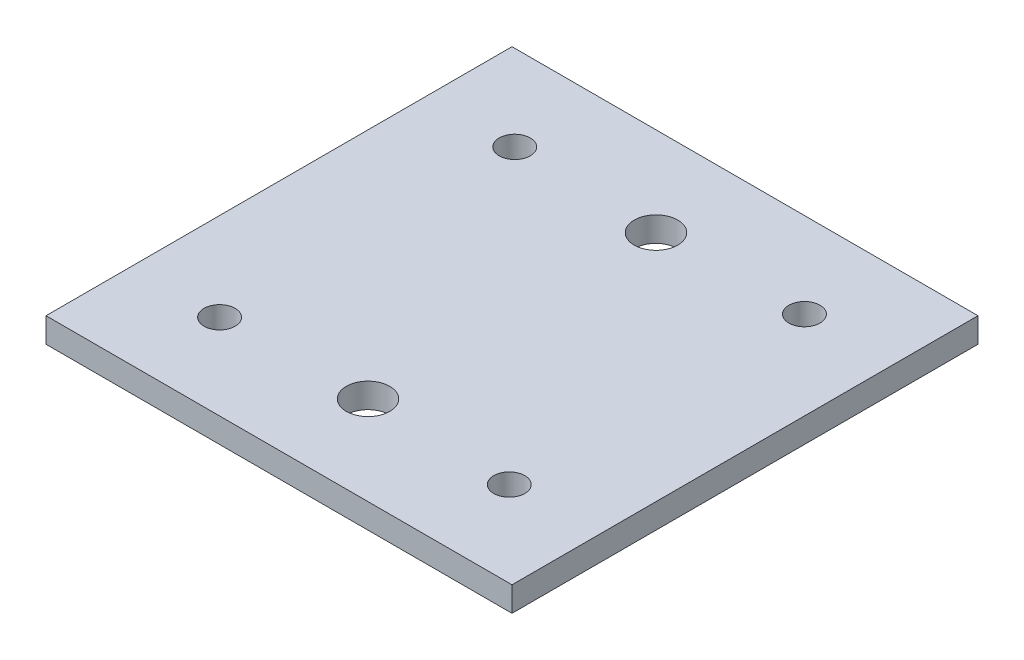
ISO-10303-21;
HEADER;
FILE_DESCRIPTION(('STEP AP214'),'2;1');
FILE_NAME('part.step','',(''),(''),'','','');
FILE_SCHEMA(('AUTOMOTIVE_DESIGN { 1 0 10303 214 1 1 1 1 }'));
ENDSEC;
DATA;
#1=APPLICATION_CONTEXT('core data for automotive mechanical design processes');
#2=APPLICATION_PROTOCOL_DEFINITION('international standard','automotive_design',2000,#1);
#3=PRODUCT_CONTEXT('',#1,'mechanical');
#4=PRODUCT('Part','Part','',(#3));
#5=PRODUCT_RELATED_PRODUCT_CATEGORY('part','',(#4));
#6=PRODUCT_DEFINITION_FORMATION('','',#4);
#7=PRODUCT_DEFINITION_CONTEXT('part definition',#1,'design');
#8=PRODUCT_DEFINITION('design','',#6,#7);
#9=PRODUCT_DEFINITION_SHAPE('','',#8);
#10=(LENGTH_UNIT() NAMED_UNIT(*) SI_UNIT(.MILLI.,.METRE.));
#11=(NAMED_UNIT(*) PLANE_ANGLE_UNIT() SI_UNIT($,.RADIAN.));
#12=(NAMED_UNIT(*) SI_UNIT($,.STERADIAN.) SOLID_ANGLE_UNIT());
#13=UNCERTAINTY_MEASURE_WITH_UNIT(LENGTH_MEASURE(1.E-05),#10,'distance_accuracy_value','');
#14=(GEOMETRIC_REPRESENTATION_CONTEXT(3) GLOBAL_UNCERTAINTY_ASSIGNED_CONTEXT((#13)) GLOBAL_UNIT_ASSIGNED_CONTEXT((#10,
#11,#12)) REPRESENTATION_CONTEXT('',''));
#15=CARTESIAN_POINT('',(0.,0.,0.));
#16=DIRECTION('',(0.,0.,1.));
#17=DIRECTION('',(1.,0.,0.));
#18=AXIS2_PLACEMENT_3D('',#15,#16,#17);
#19=CARTESIAN_POINT('',(150.,-7.96221322537112,0.));
#20=DIRECTION('',(0.,1.,0.));
#21=DIRECTION('',(0.,0.,1.));
#22=AXIS2_PLACEMENT_3D('',#19,#20,#21);
#23=PLANE('',#22);
#24=CARTESIAN_POINT('',(121.628503538993,-7.96221322537112,-122.5));
#25=DIRECTION('',(0.,-1.,0.));
#26=DIRECTION('',(0.,0.,1.));
#27=AXIS2_PLACEMENT_3D('',#24,#25,#26);
#28=CIRCLE('',#27,5.00000000000001);
#29=CARTESIAN_POINT('',(121.628503538993,-7.96221322537112,-117.5));
#30=VERTEX_POINT('',#29);
#31=EDGE_CURVE('E127',#30,#30,#28,.T.);
#32=ORIENTED_EDGE('',*,*,#31,.F.);
#33=EDGE_LOOP('',(#32));
#34=FACE_BOUND('',#33,.T.);
#35=CARTESIAN_POINT('',(121.628503538993,-7.96221322537112,-27.5));
#36=DIRECTION('',(0.,-1.,0.));
#37=DIRECTION('',(0.,0.,-1.));
#38=AXIS2_PLACEMENT_3D('',#35,#36,#37);
#39=CIRCLE('',#38,4.99999999999999);
#40=CARTESIAN_POINT('',(121.628503538993,-7.96221322537112,-32.5));
#41=VERTEX_POINT('',#40);
#42=EDGE_CURVE('E133',#41,#41,#39,.T.);
#43=ORIENTED_EDGE('',*,*,#42,.F.);
#44=EDGE_LOOP('',(#43));
#45=FACE_BOUND('',#44,.T.);
#46=CARTESIAN_POINT('',(28.3714964610074,-7.96221322537112,-27.5));
#47=DIRECTION('',(0.,-1.,0.));
#48=DIRECTION('',(0.,0.,1.));
#49=AXIS2_PLACEMENT_3D('',#46,#47,#48);
#50=CIRCLE('',#49,4.99999999999999);
#51=CARTESIAN_POINT('',(28.3714964610074,-7.96221322537112,-22.5));
#52=VERTEX_POINT('',#51);
#53=EDGE_CURVE('E139',#52,#52,#50,.T.);
#54=ORIENTED_EDGE('',*,*,#53,.F.);
#55=EDGE_LOOP('',(#54));
#56=FACE_BOUND('',#55,.T.);
#57=CARTESIAN_POINT('',(28.3714964610074,-7.96221322537112,-122.5));
#58=DIRECTION('',(0.,-1.,0.));
#59=DIRECTION('',(0.,0.,-1.));
#60=AXIS2_PLACEMENT_3D('',#57,#58,#59);
#61=CIRCLE('',#60,5.);
#62=CARTESIAN_POINT('',(28.3714964610074,-7.96221322537112,-127.5));
#63=VERTEX_POINT('',#62);
#64=EDGE_CURVE('E121',#63,#63,#61,.T.);
#65=ORIENTED_EDGE('',*,*,#64,.F.);
#66=EDGE_LOOP('',(#65));
#67=FACE_BOUND('',#66,.T.);
#68=DIRECTION('',(0.,0.,-1.));
#69=VECTOR('',#68,1.);
#70=CARTESIAN_POINT('',(0.,-7.96221322537112,0.));
#71=LINE('',#70,#69);
#72=CARTESIAN_POINT('',(0.,-7.96221322537112,0.));
#73=VERTEX_POINT('',#72);
#74=CARTESIAN_POINT('',(0.,-7.96221322537112,-150.));
#75=VERTEX_POINT('',#74);
#76=EDGE_CURVE('E88',#73,#75,#71,.T.);
#77=ORIENTED_EDGE('',*,*,#76,.T.);
#78=DIRECTION('',(-1.,0.,0.));
#79=VECTOR('',#78,1.);
#80=CARTESIAN_POINT('',(150.,-7.96221322537112,-150.));
#81=LINE('',#80,#79);
#82=CARTESIAN_POINT('',(150.,-7.96221322537112,-150.));
#83=VERTEX_POINT('',#82);
#84=EDGE_CURVE('E42',#83,#75,#81,.T.);
#85=ORIENTED_EDGE('',*,*,#84,.F.);
#86=DIRECTION('',(0.,0.,-1.));
#87=VECTOR('',#86,1.);
#88=CARTESIAN_POINT('',(150.,-7.96221322537112,0.));
#89=LINE('',#88,#87);
#90=CARTESIAN_POINT('',(150.,-7.96221322537112,0.));
#91=VERTEX_POINT('',#90);
#92=EDGE_CURVE('E75',#91,#83,#89,.T.);
#93=ORIENTED_EDGE('',*,*,#92,.F.);
#94=DIRECTION('',(-1.,0.,0.));
#95=VECTOR('',#94,1.);
#96=CARTESIAN_POINT('',(150.,-7.96221322537112,0.));
#97=LINE('',#96,#95);
#98=EDGE_CURVE('E11',#91,#73,#97,.T.);
#99=ORIENTED_EDGE('',*,*,#98,.T.);
#100=EDGE_LOOP('',(#77,#85,#93,#99));
#101=FACE_BOUND('',#100,.T.);
#102=CARTESIAN_POINT('',(74.999907538728,-7.96221322537112,-28.6526060996607));
#103=DIRECTION('',(0.,-1.,0.));
#104=DIRECTION('',(0.,0.,-1.));
#105=AXIS2_PLACEMENT_3D('',#102,#103,#104);
#106=CIRCLE('',#105,7.0000000000002);
#107=CARTESIAN_POINT('',(74.999907538728,-7.96221322537112,-35.6526060996609));
#108=VERTEX_POINT('',#107);
#109=EDGE_CURVE('E109',#108,#108,#106,.T.);
#110=ORIENTED_EDGE('',*,*,#109,.F.);
#111=EDGE_LOOP('',(#110));
#112=FACE_BOUND('',#111,.T.);
#113=CARTESIAN_POINT('',(74.999907538728,-7.96221322537112,-121.347393900339));
#114=DIRECTION('',(0.,1.,0.));
#115=DIRECTION('',(0.,0.,1.));
#116=AXIS2_PLACEMENT_3D('',#113,#114,#115);
#117=CIRCLE('',#116,7.0000000000002);
#118=CARTESIAN_POINT('',(74.999907538728,-7.96221322537112,-114.347393900339));
#119=VERTEX_POINT('',#118);
#120=EDGE_CURVE('E99',#119,#119,#117,.T.);
#121=ORIENTED_EDGE('',*,*,#120,.T.);
#122=EDGE_LOOP('',(#121));
#123=FACE_BOUND('',#122,.T.);
#124=ADVANCED_FACE('F33',(#34,#45,#56,#67,#101,#112,#123),#23,.F.);
#125=CARTESIAN_POINT('',(150.,0.,0.));
#126=DIRECTION('',(0.,1.,0.));
#127=DIRECTION('',(0.,0.,1.));
#128=AXIS2_PLACEMENT_3D('',#125,#126,#127);
#129=PLANE('',#128);
#130=CARTESIAN_POINT('',(121.628503538993,0.,-122.5));
#131=DIRECTION('',(0.,-1.,0.));
#132=DIRECTION('',(0.,0.,1.));
#133=AXIS2_PLACEMENT_3D('',#130,#131,#132);
#134=CIRCLE('',#133,5.00000000000001);
#135=CARTESIAN_POINT('',(121.628503538993,0.,-117.5));
#136=VERTEX_POINT('',#135);
#137=EDGE_CURVE('E130',#136,#136,#134,.T.);
#138=ORIENTED_EDGE('',*,*,#137,.T.);
#139=EDGE_LOOP('',(#138));
#140=FACE_BOUND('',#139,.T.);
#141=CARTESIAN_POINT('',(121.628503538993,0.,-27.5));
#142=DIRECTION('',(0.,-1.,0.));
#143=DIRECTION('',(0.,0.,-1.));
#144=AXIS2_PLACEMENT_3D('',#141,#142,#143);
#145=CIRCLE('',#144,4.99999999999999);
#146=CARTESIAN_POINT('',(121.628503538993,0.,-32.5));
#147=VERTEX_POINT('',#146);
#148=EDGE_CURVE('E136',#147,#147,#145,.T.);
#149=ORIENTED_EDGE('',*,*,#148,.T.);
#150=EDGE_LOOP('',(#149));
#151=FACE_BOUND('',#150,.T.);
#152=CARTESIAN_POINT('',(28.3714964610074,0.,-27.5));
#153=DIRECTION('',(0.,-1.,0.));
#154=DIRECTION('',(0.,0.,1.));
#155=AXIS2_PLACEMENT_3D('',#152,#153,#154);
#156=CIRCLE('',#155,4.99999999999999);
#157=CARTESIAN_POINT('',(28.3714964610074,0.,-22.5));
#158=VERTEX_POINT('',#157);
#159=EDGE_CURVE('E124',#158,#158,#156,.T.);
#160=ORIENTED_EDGE('',*,*,#159,.T.);
#161=EDGE_LOOP('',(#160));
#162=FACE_BOUND('',#161,.T.);
#163=CARTESIAN_POINT('',(28.3714964610074,0.,-122.5));
#164=DIRECTION('',(0.,-1.,0.));
#165=DIRECTION('',(0.,0.,-1.));
#166=AXIS2_PLACEMENT_3D('',#163,#164,#165);
#167=CIRCLE('',#166,5.);
#168=CARTESIAN_POINT('',(28.3714964610074,0.,-127.5));
#169=VERTEX_POINT('',#168);
#170=EDGE_CURVE('E113',#169,#169,#167,.T.);
#171=ORIENTED_EDGE('',*,*,#170,.T.);
#172=EDGE_LOOP('',(#171));
#173=FACE_BOUND('',#172,.T.);
#174=CARTESIAN_POINT('',(74.999907538728,0.,-28.6526060996607));
#175=DIRECTION('',(0.,-1.,0.));
#176=DIRECTION('',(0.,0.,-1.));
#177=AXIS2_PLACEMENT_3D('',#174,#175,#176);
#178=CIRCLE('',#177,7.0000000000002);
#179=CARTESIAN_POINT('',(74.999907538728,0.,-35.6526060996609));
#180=VERTEX_POINT('',#179);
#181=EDGE_CURVE('E112',#180,#180,#178,.T.);
#182=ORIENTED_EDGE('',*,*,#181,.T.);
#183=EDGE_LOOP('',(#182));
#184=FACE_BOUND('',#183,.T.);
#185=DIRECTION('',(0.,0.,-1.));
#186=VECTOR('',#185,1.);
#187=CARTESIAN_POINT('',(0.,0.,0.));
#188=LINE('',#187,#186);
#189=CARTESIAN_POINT('',(0.,0.,0.));
#190=VERTEX_POINT('',#189);
#191=CARTESIAN_POINT('',(0.,0.,-150.));
#192=VERTEX_POINT('',#191);
#193=EDGE_CURVE('E103',#190,#192,#188,.T.);
#194=ORIENTED_EDGE('',*,*,#193,.F.);
#195=DIRECTION('',(-1.,0.,0.));
#196=VECTOR('',#195,1.);
#197=CARTESIAN_POINT('',(150.,0.,0.));
#198=LINE('',#197,#196);
#199=CARTESIAN_POINT('',(150.,0.,0.));
#200=VERTEX_POINT('',#199);
#201=EDGE_CURVE('E50',#200,#190,#198,.T.);
#202=ORIENTED_EDGE('',*,*,#201,.F.);
#203=DIRECTION('',(0.,0.,-1.));
#204=VECTOR('',#203,1.);
#205=CARTESIAN_POINT('',(150.,0.,0.));
#206=LINE('',#205,#204);
#207=CARTESIAN_POINT('',(150.,0.,-150.));
#208=VERTEX_POINT('',#207);
#209=EDGE_CURVE('E92',#200,#208,#206,.T.);
#210=ORIENTED_EDGE('',*,*,#209,.T.);
#211=DIRECTION('',(-1.,0.,0.));
#212=VECTOR('',#211,1.);
#213=CARTESIAN_POINT('',(150.,0.,-150.));
#214=LINE('',#213,#212);
#215=EDGE_CURVE('E64',#208,#192,#214,.T.);
#216=ORIENTED_EDGE('',*,*,#215,.T.);
#217=EDGE_LOOP('',(#194,#202,#210,#216));
#218=FACE_BOUND('',#217,.T.);
#219=CARTESIAN_POINT('',(74.999907538728,0.,-121.347393900339));
#220=DIRECTION('',(0.,1.,0.));
#221=DIRECTION('',(0.,0.,1.));
#222=AXIS2_PLACEMENT_3D('',#219,#220,#221);
#223=CIRCLE('',#222,7.0000000000002);
#224=CARTESIAN_POINT('',(74.999907538728,0.,-114.347393900339));
#225=VERTEX_POINT('',#224);
#226=EDGE_CURVE('E116',#225,#225,#223,.T.);
#227=ORIENTED_EDGE('',*,*,#226,.F.);
#228=EDGE_LOOP('',(#227));
#229=FACE_BOUND('',#228,.T.);
#230=ADVANCED_FACE('F145',(#140,#151,#162,#173,#184,#218,#229),#129,.T.);
#231=CARTESIAN_POINT('',(150.,0.,0.));
#232=DIRECTION('',(0.,0.,-1.));
#233=DIRECTION('',(-1.,0.,0.));
#234=AXIS2_PLACEMENT_3D('',#231,#232,#233);
#235=PLANE('',#234);
#236=DIRECTION('',(0.,-1.,0.));
#237=VECTOR('',#236,1.);
#238=CARTESIAN_POINT('',(0.,0.,0.));
#239=LINE('',#238,#237);
#240=EDGE_CURVE('E97',#190,#73,#239,.T.);
#241=ORIENTED_EDGE('',*,*,#240,.T.);
#242=ORIENTED_EDGE('',*,*,#98,.F.);
#243=DIRECTION('',(0.,-1.,0.));
#244=VECTOR('',#243,1.);
#245=CARTESIAN_POINT('',(150.,0.,0.));
#246=LINE('',#245,#244);
#247=EDGE_CURVE('E83',#200,#91,#246,.T.);
#248=ORIENTED_EDGE('',*,*,#247,.F.);
#249=ORIENTED_EDGE('',*,*,#201,.T.);
#250=EDGE_LOOP('',(#241,#242,#248,#249));
#251=FACE_BOUND('',#250,.T.);
#252=ADVANCED_FACE('F35',(#251),#235,.F.);
#253=CARTESIAN_POINT('',(150.,0.,-150.));
#254=DIRECTION('',(0.,0.,-1.));
#255=DIRECTION('',(-1.,0.,0.));
#256=AXIS2_PLACEMENT_3D('',#253,#254,#255);
#257=PLANE('',#256);
#258=DIRECTION('',(0.,-1.,0.));
#259=VECTOR('',#258,1.);
#260=CARTESIAN_POINT('',(0.,0.,-150.));
#261=LINE('',#260,#259);
#262=EDGE_CURVE('E101',#192,#75,#261,.T.);
#263=ORIENTED_EDGE('',*,*,#262,.F.);
#264=ORIENTED_EDGE('',*,*,#215,.F.);
#265=DIRECTION('',(0.,-1.,0.));
#266=VECTOR('',#265,1.);
#267=CARTESIAN_POINT('',(150.,0.,-150.));
#268=LINE('',#267,#266);
#269=EDGE_CURVE('E82',#208,#83,#268,.T.);
#270=ORIENTED_EDGE('',*,*,#269,.T.);
#271=ORIENTED_EDGE('',*,*,#84,.T.);
#272=EDGE_LOOP('',(#263,#264,#270,#271));
#273=FACE_BOUND('',#272,.T.);
#274=ADVANCED_FACE('F91',(#273),#257,.T.);
#275=CARTESIAN_POINT('',(150.,0.,0.));
#276=DIRECTION('',(1.,0.,0.));
#277=DIRECTION('',(0.,0.,-1.));
#278=AXIS2_PLACEMENT_3D('',#275,#276,#277);
#279=PLANE('',#278);
#280=ORIENTED_EDGE('',*,*,#247,.T.);
#281=ORIENTED_EDGE('',*,*,#92,.T.);
#282=ORIENTED_EDGE('',*,*,#269,.F.);
#283=ORIENTED_EDGE('',*,*,#209,.F.);
#284=EDGE_LOOP('',(#280,#281,#282,#283));
#285=FACE_BOUND('',#284,.T.);
#286=ADVANCED_FACE('F79',(#285),#279,.T.);
#287=CARTESIAN_POINT('',(0.,0.,0.));
#288=DIRECTION('',(1.,0.,0.));
#289=DIRECTION('',(0.,0.,-1.));
#290=AXIS2_PLACEMENT_3D('',#287,#288,#289);
#291=PLANE('',#290);
#292=ORIENTED_EDGE('',*,*,#240,.F.);
#293=ORIENTED_EDGE('',*,*,#193,.T.);
#294=ORIENTED_EDGE('',*,*,#262,.T.);
#295=ORIENTED_EDGE('',*,*,#76,.F.);
#296=EDGE_LOOP('',(#292,#293,#294,#295));
#297=FACE_BOUND('',#296,.T.);
#298=ADVANCED_FACE('F178',(#297),#291,.F.);
#299=CARTESIAN_POINT('',(74.999907538728,-7.96221322537112,-28.6526060996607));
#300=DIRECTION('',(0.,1.,0.));
#301=DIRECTION('',(0.,0.,1.));
#302=AXIS2_PLACEMENT_3D('',#299,#300,#301);
#303=CYLINDRICAL_SURFACE('',#302,7.0000000000002);
#304=ORIENTED_EDGE('',*,*,#109,.T.);
#305=EDGE_LOOP('',(#304));
#306=FACE_BOUND('',#305,.T.);
#307=ORIENTED_EDGE('',*,*,#181,.F.);
#308=EDGE_LOOP('',(#307));
#309=FACE_BOUND('',#308,.T.);
#310=ADVANCED_FACE('F168',(#306,#309),#303,.F.);
#311=CARTESIAN_POINT('',(74.999907538728,-7.96221322537112,-121.347393900339));
#312=DIRECTION('',(0.,1.,0.));
#313=DIRECTION('',(0.,0.,1.));
#314=AXIS2_PLACEMENT_3D('',#311,#312,#313);
#315=CYLINDRICAL_SURFACE('',#314,7.0000000000002);
#316=ORIENTED_EDGE('',*,*,#120,.F.);
#317=EDGE_LOOP('',(#316));
#318=FACE_BOUND('',#317,.T.);
#319=ORIENTED_EDGE('',*,*,#226,.T.);
#320=EDGE_LOOP('',(#319));
#321=FACE_BOUND('',#320,.T.);
#322=ADVANCED_FACE('F162',(#318,#321),#315,.F.);
#323=CARTESIAN_POINT('',(28.3714964610074,0.,-122.5));
#324=DIRECTION('',(0.,-1.,0.));
#325=DIRECTION('',(0.,0.,-1.));
#326=AXIS2_PLACEMENT_3D('',#323,#324,#325);
#327=CYLINDRICAL_SURFACE('',#326,5.);
#328=ORIENTED_EDGE('',*,*,#170,.F.);
#329=EDGE_LOOP('',(#328));
#330=FACE_BOUND('',#329,.T.);
#331=ORIENTED_EDGE('',*,*,#64,.T.);
#332=EDGE_LOOP('',(#331));
#333=FACE_BOUND('',#332,.T.);
#334=ADVANCED_FACE('F152',(#330,#333),#327,.F.);
#335=CARTESIAN_POINT('',(28.3714964610074,0.,-27.5));
#336=DIRECTION('',(0.,-1.,0.));
#337=DIRECTION('',(0.,0.,-1.));
#338=AXIS2_PLACEMENT_3D('',#335,#336,#337);
#339=CYLINDRICAL_SURFACE('',#338,4.99999999999999);
#340=ORIENTED_EDGE('',*,*,#159,.F.);
#341=EDGE_LOOP('',(#340));
#342=FACE_BOUND('',#341,.T.);
#343=ORIENTED_EDGE('',*,*,#53,.T.);
#344=EDGE_LOOP('',(#343));
#345=FACE_BOUND('',#344,.T.);
#346=ADVANCED_FACE('F148',(#342,#345),#339,.F.);
#347=CARTESIAN_POINT('',(121.628503538993,0.,-27.5));
#348=DIRECTION('',(0.,-1.,0.));
#349=DIRECTION('',(0.,0.,-1.));
#350=AXIS2_PLACEMENT_3D('',#347,#348,#349);
#351=CYLINDRICAL_SURFACE('',#350,4.99999999999999);
#352=ORIENTED_EDGE('',*,*,#148,.F.);
#353=EDGE_LOOP('',(#352));
#354=FACE_BOUND('',#353,.T.);
#355=ORIENTED_EDGE('',*,*,#42,.T.);
#356=EDGE_LOOP('',(#355));
#357=FACE_BOUND('',#356,.T.);
#358=ADVANCED_FACE('F151',(#354,#357),#351,.F.);
#359=CARTESIAN_POINT('',(121.628503538993,0.,-122.5));
#360=DIRECTION('',(0.,-1.,0.));
#361=DIRECTION('',(0.,0.,-1.));
#362=AXIS2_PLACEMENT_3D('',#359,#360,#361);
#363=CYLINDRICAL_SURFACE('',#362,5.00000000000001);
#364=ORIENTED_EDGE('',*,*,#137,.F.);
#365=EDGE_LOOP('',(#364));
#366=FACE_BOUND('',#365,.T.);
#367=ORIENTED_EDGE('',*,*,#31,.T.);
#368=EDGE_LOOP('',(#367));
#369=FACE_BOUND('',#368,.T.);
#370=ADVANCED_FACE('F173',(#366,#369),#363,.F.);
#371=CLOSED_SHELL('',(#124,#230,#252,#274,#286,#298,#310,#322,#334,#346,#358,#370));
#372=MANIFOLD_SOLID_BREP('B2',#371);
#373=ADVANCED_BREP_SHAPE_REPRESENTATION('',(#18,#372),#14);
#374=SHAPE_DEFINITION_REPRESENTATION(#9,#373);
ENDSEC;
END-ISO-10303-21;
